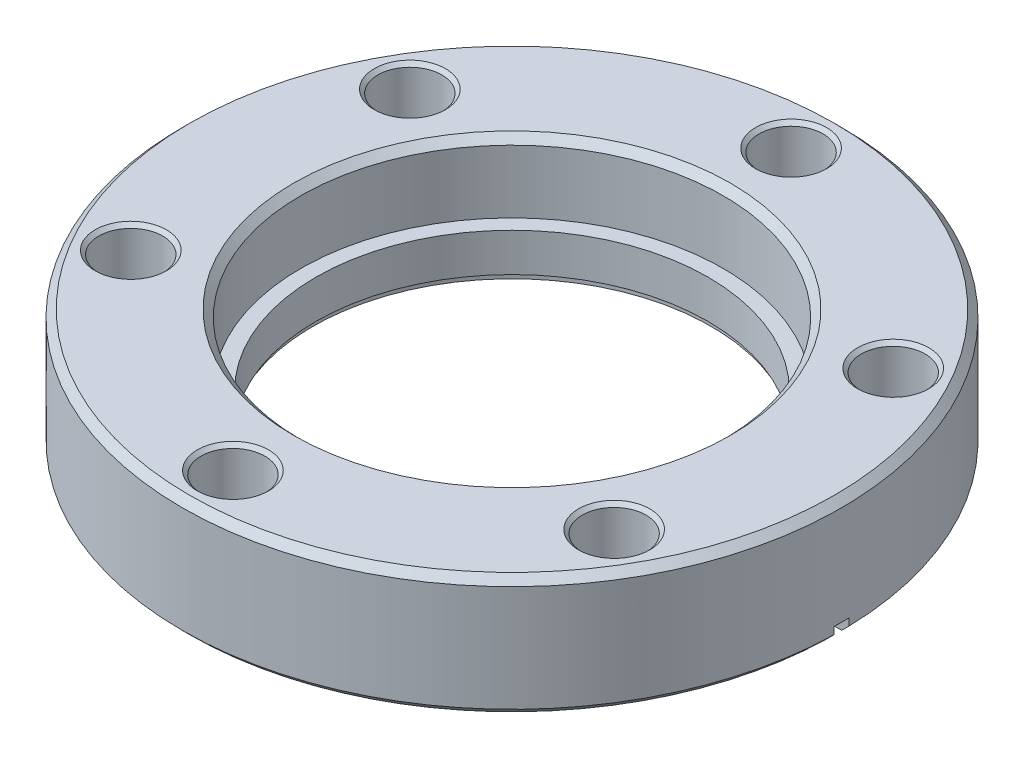
ISO-10303-21;
HEADER;
FILE_DESCRIPTION(('STEP AP214'),'2;1');
FILE_NAME('part.step','',(''),(''),'','','');
FILE_SCHEMA(('AUTOMOTIVE_DESIGN { 1 0 10303 214 1 1 1 1 }'));
ENDSEC;
DATA;
#1=APPLICATION_CONTEXT('core data for automotive mechanical design processes');
#2=APPLICATION_PROTOCOL_DEFINITION('international standard','automotive_design',2000,#1);
#3=PRODUCT_CONTEXT('',#1,'mechanical');
#4=PRODUCT('Part','Part','',(#3));
#5=PRODUCT_RELATED_PRODUCT_CATEGORY('part','',(#4));
#6=PRODUCT_DEFINITION_FORMATION('','',#4);
#7=PRODUCT_DEFINITION_CONTEXT('part definition',#1,'design');
#8=PRODUCT_DEFINITION('design','',#6,#7);
#9=PRODUCT_DEFINITION_SHAPE('','',#8);
#10=(LENGTH_UNIT() NAMED_UNIT(*) SI_UNIT(.MILLI.,.METRE.));
#11=(NAMED_UNIT(*) PLANE_ANGLE_UNIT() SI_UNIT($,.RADIAN.));
#12=(NAMED_UNIT(*) SI_UNIT($,.STERADIAN.) SOLID_ANGLE_UNIT());
#13=UNCERTAINTY_MEASURE_WITH_UNIT(LENGTH_MEASURE(1.E-05),#10,'distance_accuracy_value','');
#14=(GEOMETRIC_REPRESENTATION_CONTEXT(3) GLOBAL_UNCERTAINTY_ASSIGNED_CONTEXT((#13)) GLOBAL_UNIT_ASSIGNED_CONTEXT((#10,
#11,#12)) REPRESENTATION_CONTEXT('',''));
#15=CARTESIAN_POINT('',(0.,0.,0.));
#16=DIRECTION('',(0.,0.,1.));
#17=DIRECTION('',(1.,0.,0.));
#18=AXIS2_PLACEMENT_3D('',#15,#16,#17);
#19=CARTESIAN_POINT('',(0.,0.,0.));
#20=DIRECTION('',(0.,1.,0.));
#21=DIRECTION('',(0.,0.,1.));
#22=AXIS2_PLACEMENT_3D('',#19,#20,#21);
#23=PLANE('',#22);
#24=CARTESIAN_POINT('',(-25.42858431608,0.,-14.6812000000003));
#25=DIRECTION('',(0.,1.,0.));
#26=DIRECTION('',(0.,0.,1.));
#27=AXIS2_PLACEMENT_3D('',#24,#25,#26);
#28=CIRCLE('',#27,3.74650000000003);
#29=CARTESIAN_POINT('',(-25.42858431608,0.,-10.9347000000003));
#30=VERTEX_POINT('',#29);
#31=EDGE_CURVE('E253',#30,#30,#28,.T.);
#32=ORIENTED_EDGE('',*,*,#31,.T.);
#33=EDGE_LOOP('',(#32));
#34=FACE_BOUND('',#33,.T.);
#35=CARTESIAN_POINT('',(25.4285843160802,0.,-14.6811999999999));
#36=DIRECTION('',(0.,1.,0.));
#37=DIRECTION('',(0.,0.,1.));
#38=AXIS2_PLACEMENT_3D('',#35,#36,#37);
#39=CIRCLE('',#38,3.7465);
#40=CARTESIAN_POINT('',(25.4285843160802,0.,-10.9346999999999));
#41=VERTEX_POINT('',#40);
#42=EDGE_CURVE('E257',#41,#41,#39,.T.);
#43=ORIENTED_EDGE('',*,*,#42,.T.);
#44=EDGE_LOOP('',(#43));
#45=FACE_BOUND('',#44,.T.);
#46=CARTESIAN_POINT('',(0.,0.,-29.3624));
#47=DIRECTION('',(0.,1.,0.));
#48=DIRECTION('',(0.,0.,1.));
#49=AXIS2_PLACEMENT_3D('',#46,#47,#48);
#50=CIRCLE('',#49,3.74649999999999);
#51=CARTESIAN_POINT('',(0.,0.,-25.6159));
#52=VERTEX_POINT('',#51);
#53=EDGE_CURVE('E261',#52,#52,#50,.T.);
#54=ORIENTED_EDGE('',*,*,#53,.T.);
#55=EDGE_LOOP('',(#54));
#56=FACE_BOUND('',#55,.T.);
#57=DIRECTION('',(1.,0.,0.));
#58=VECTOR('',#57,1.);
#59=CARTESIAN_POINT('',(0.,0.,-0.79375));
#60=LINE('',#59,#58);
#61=CARTESIAN_POINT('',(-33.8997085818964,0.,-0.79375));
#62=VERTEX_POINT('',#61);
#63=CARTESIAN_POINT('',(-24.1423551066896,0.,-0.79375));
#64=VERTEX_POINT('',#63);
#65=EDGE_CURVE('E115',#62,#64,#60,.T.);
#66=ORIENTED_EDGE('',*,*,#65,.F.);
#67=CARTESIAN_POINT('',(0.,0.,0.));
#68=DIRECTION('',(0.,1.,0.));
#69=DIRECTION('',(0.,0.,1.));
#70=AXIS2_PLACEMENT_3D('',#67,#68,#69);
#71=CIRCLE('',#70,33.909);
#72=CARTESIAN_POINT('',(33.8997085818964,0.,-0.79375));
#73=VERTEX_POINT('',#72);
#74=EDGE_CURVE('E266',#62,#73,#71,.F.);
#75=ORIENTED_EDGE('',*,*,#74,.T.);
#76=DIRECTION('',(-1.,0.,0.));
#77=VECTOR('',#76,1.);
#78=CARTESIAN_POINT('',(0.,0.,-0.79375));
#79=LINE('',#78,#77);
#80=CARTESIAN_POINT('',(24.1423551066896,0.,-0.79375));
#81=VERTEX_POINT('',#80);
#82=EDGE_CURVE('E685',#73,#81,#79,.T.);
#83=ORIENTED_EDGE('',*,*,#82,.T.);
#84=CARTESIAN_POINT('',(0.,0.,0.));
#85=DIRECTION('',(0.,1.,0.));
#86=DIRECTION('',(0.,0.,1.));
#87=AXIS2_PLACEMENT_3D('',#84,#85,#86);
#88=CIRCLE('',#87,24.1554);
#89=EDGE_CURVE('E269',#81,#64,#88,.T.);
#90=ORIENTED_EDGE('',*,*,#89,.T.);
#91=EDGE_LOOP('',(#66,#75,#83,#90));
#92=FACE_BOUND('',#91,.T.);
#93=ADVANCED_FACE('F32',(#34,#45,#56,#92),#23,.F.);
#94=CARTESIAN_POINT('',(0.,12.7,0.));
#95=DIRECTION('',(0.,-1.,0.));
#96=DIRECTION('',(0.,0.,-1.));
#97=AXIS2_PLACEMENT_3D('',#94,#95,#96);
#98=CYLINDRICAL_SURFACE('',#97,34.671);
#99=CARTESIAN_POINT('',(0.,11.938,0.));
#100=DIRECTION('',(0.,1.,0.));
#101=DIRECTION('',(0.,0.,1.));
#102=AXIS2_PLACEMENT_3D('',#99,#100,#101);
#103=CIRCLE('',#102,34.671);
#104=CARTESIAN_POINT('',(0.,11.938,34.671));
#105=VERTEX_POINT('',#104);
#106=EDGE_CURVE('E667',#105,#105,#103,.F.);
#107=ORIENTED_EDGE('',*,*,#106,.T.);
#108=EDGE_LOOP('',(#107));
#109=FACE_BOUND('',#108,.T.);
#110=DIRECTION('',(0.,-1.,0.));
#111=VECTOR('',#110,1.);
#112=CARTESIAN_POINT('',(-34.6619128430255,12.7,-0.79375));
#113=LINE('',#112,#111);
#114=CARTESIAN_POINT('',(-34.6619128430255,1.51703707780505,-0.79375));
#115=VERTEX_POINT('',#114);
#116=CARTESIAN_POINT('',(-34.6619128430255,0.761999999999984,-0.79375));
#117=VERTEX_POINT('',#116);
#118=EDGE_CURVE('E129',#115,#117,#113,.T.);
#119=ORIENTED_EDGE('',*,*,#118,.F.);
#120=CARTESIAN_POINT('',(0.,-0.299516800000002,0.));
#121=DIRECTION('',(0.0523359562429369,0.998629534754574,0.));
#122=DIRECTION('',(0.998629534754574,-0.0523359562429369,0.));
#123=AXIS2_PLACEMENT_3D('',#120,#121,#122);
#124=ELLIPSE('',#123,34.7185806080939,34.671);
#125=CARTESIAN_POINT('',(-34.6619128430255,1.51703707780505,0.79375));
#126=VERTEX_POINT('',#125);
#127=EDGE_CURVE('E120',#115,#126,#124,.T.);
#128=ORIENTED_EDGE('',*,*,#127,.T.);
#129=DIRECTION('',(0.,-1.,0.));
#130=VECTOR('',#129,1.);
#131=CARTESIAN_POINT('',(-34.6619128430255,12.7,0.79375));
#132=LINE('',#131,#130);
#133=CARTESIAN_POINT('',(-34.6619128430255,0.761999999999984,0.79375));
#134=VERTEX_POINT('',#133);
#135=EDGE_CURVE('E108',#126,#134,#132,.T.);
#136=ORIENTED_EDGE('',*,*,#135,.T.);
#137=CARTESIAN_POINT('',(0.,0.761999999999985,0.));
#138=DIRECTION('',(0.,1.,0.));
#139=DIRECTION('',(0.,0.,1.));
#140=AXIS2_PLACEMENT_3D('',#137,#138,#139);
#141=CIRCLE('',#140,34.671);
#142=CARTESIAN_POINT('',(34.6619128430255,0.761999999999984,0.79375));
#143=VERTEX_POINT('',#142);
#144=EDGE_CURVE('E283',#134,#143,#141,.T.);
#145=ORIENTED_EDGE('',*,*,#144,.T.);
#146=DIRECTION('',(0.,-1.,0.));
#147=VECTOR('',#146,1.);
#148=CARTESIAN_POINT('',(34.6619128430255,12.7,0.79375));
#149=LINE('',#148,#147);
#150=CARTESIAN_POINT('',(34.6619128430255,1.51703707780506,0.79375));
#151=VERTEX_POINT('',#150);
#152=EDGE_CURVE('E151',#151,#143,#149,.T.);
#153=ORIENTED_EDGE('',*,*,#152,.F.);
#154=CARTESIAN_POINT('',(0.,-0.2995168,0.));
#155=DIRECTION('',(-0.052335956242937,0.998629534754574,0.));
#156=DIRECTION('',(-0.998629534754574,-0.052335956242937,0.));
#157=AXIS2_PLACEMENT_3D('',#154,#155,#156);
#158=ELLIPSE('',#157,34.7185806080939,34.671);
#159=CARTESIAN_POINT('',(34.6619128430255,1.51703707780506,-0.79375));
#160=VERTEX_POINT('',#159);
#161=EDGE_CURVE('E694',#151,#160,#158,.T.);
#162=ORIENTED_EDGE('',*,*,#161,.T.);
#163=DIRECTION('',(0.,-1.,0.));
#164=VECTOR('',#163,1.);
#165=CARTESIAN_POINT('',(34.6619128430255,12.7,-0.79375));
#166=LINE('',#165,#164);
#167=CARTESIAN_POINT('',(34.6619128430255,0.761999999999984,-0.79375));
#168=VERTEX_POINT('',#167);
#169=EDGE_CURVE('E686',#160,#168,#166,.T.);
#170=ORIENTED_EDGE('',*,*,#169,.T.);
#171=EDGE_CURVE('E279',#168,#117,#141,.T.);
#172=ORIENTED_EDGE('',*,*,#171,.T.);
#173=EDGE_LOOP('',(#119,#128,#136,#145,#153,#162,#170,#172));
#174=FACE_BOUND('',#173,.T.);
#175=ADVANCED_FACE('F127',(#109,#174),#98,.T.);
#176=CARTESIAN_POINT('',(0.,0.761999999999985,0.));
#177=DIRECTION('',(0.,1.,0.));
#178=DIRECTION('',(0.,0.,1.));
#179=AXIS2_PLACEMENT_3D('',#176,#177,#178);
#180=CONICAL_SURFACE('',#179,34.671,0.785398163397453);
#181=ORIENTED_EDGE('',*,*,#74,.F.);
#182=CARTESIAN_POINT('',(-19.8162171152629,-14.0768921992204,-0.79375));
#183=CARTESIAN_POINT('',(-20.9812335307025,-12.912799557824,-0.79375));
#184=CARTESIAN_POINT('',(-22.1461782104416,-11.7486351324414,-0.79375));
#185=CARTESIAN_POINT('',(-24.4759641840109,-9.4202028418735,-0.79375));
#186=CARTESIAN_POINT('',(-25.6408054778415,-8.2559349766886,-0.79375));
#187=CARTESIAN_POINT('',(-29.1352344081955,-4.76303641419953,-0.79375));
#188=CARTESIAN_POINT('',(-31.4647271051946,-2.4343107383554,-0.79375));
#189=CARTESIAN_POINT('',(-36.123587206694,2.22326591141915,-0.79375));
#190=CARTESIAN_POINT('',(-38.4529546111951,4.55211688534891,-0.79375));
#191=CARTESIAN_POINT('',(-43.1116115928339,9.20989669825734,-0.79375));
#192=CARTESIAN_POINT('',(-45.4409011699713,11.5388255372364,-0.79375));
#193=CARTESIAN_POINT('',(-47.7701755486075,13.8677695748391,-0.79375));
#194=B_SPLINE_CURVE_WITH_KNOTS('',3,(#182,#183,#184,#185,#186,#187,#188,#189,#190,#191,#192,
#193),.UNSPECIFIED.,.F.,.F.,(4,2,2,2,2,4),(0.,4.94078680141497,9.88157358713812,19.76314710933,
29.644720579459,39.5262940973138),.UNSPECIFIED.);
#195=EDGE_CURVE('E135',#62,#117,#194,.T.);
#196=ORIENTED_EDGE('',*,*,#195,.T.);
#197=ORIENTED_EDGE('',*,*,#171,.F.);
#198=CARTESIAN_POINT('',(19.8162171152629,-14.0768921992204,-0.79375));
#199=CARTESIAN_POINT('',(20.9812335307025,-12.912799557824,-0.79375));
#200=CARTESIAN_POINT('',(22.1461782104416,-11.7486351324414,-0.79375));
#201=CARTESIAN_POINT('',(24.4759641840109,-9.4202028418735,-0.79375));
#202=CARTESIAN_POINT('',(25.6408054778415,-8.2559349766886,-0.79375));
#203=CARTESIAN_POINT('',(29.1352344081955,-4.76303641419953,-0.79375));
#204=CARTESIAN_POINT('',(31.4647271051946,-2.4343107383554,-0.79375));
#205=CARTESIAN_POINT('',(36.123587206694,2.22326591141915,-0.79375));
#206=CARTESIAN_POINT('',(38.4529546111951,4.55211688534891,-0.79375));
#207=CARTESIAN_POINT('',(43.1116115928339,9.20989669825734,-0.79375));
#208=CARTESIAN_POINT('',(45.4409011699713,11.5388255372364,-0.79375));
#209=CARTESIAN_POINT('',(47.7701755486075,13.8677695748391,-0.79375));
#210=B_SPLINE_CURVE_WITH_KNOTS('',3,(#198,#199,#200,#201,#202,#203,#204,#205,#206,#207,#208,
#209),.UNSPECIFIED.,.F.,.F.,(4,2,2,2,2,4),(0.,4.94078680141497,9.88157358713812,19.76314710933,
29.644720579459,39.5262940973138),.UNSPECIFIED.);
#211=EDGE_CURVE('E277',#73,#168,#210,.T.);
#212=ORIENTED_EDGE('',*,*,#211,.F.);
#213=EDGE_LOOP('',(#181,#196,#197,#212));
#214=FACE_BOUND('',#213,.T.);
#215=ADVANCED_FACE('F202',(#214),#180,.T.);
#216=CARTESIAN_POINT('',(0.,5.3086,0.));
#217=DIRECTION('',(0.,1.,0.));
#218=DIRECTION('',(0.,0.,1.));
#219=AXIS2_PLACEMENT_3D('',#216,#217,#218);
#220=CYLINDRICAL_SURFACE('',#219,24.1554);
#221=CARTESIAN_POINT('',(0.,1.825244,0.));
#222=DIRECTION('',(0.,1.,0.));
#223=DIRECTION('',(0.,0.,1.));
#224=AXIS2_PLACEMENT_3D('',#221,#222,#223);
#225=CIRCLE('',#224,24.1554);
#226=CARTESIAN_POINT('',(0.,1.825244,24.1554));
#227=VERTEX_POINT('',#226);
#228=EDGE_CURVE('E697',#227,#227,#225,.T.);
#229=ORIENTED_EDGE('',*,*,#228,.T.);
#230=EDGE_LOOP('',(#229));
#231=FACE_BOUND('',#230,.T.);
#232=DIRECTION('',(0.,1.,0.));
#233=VECTOR('',#232,1.);
#234=CARTESIAN_POINT('',(-24.1423551066896,5.3086,-0.79375));
#235=LINE('',#234,#233);
#236=CARTESIAN_POINT('',(-24.1423551066896,0.965730417804022,-0.79375));
#237=VERTEX_POINT('',#236);
#238=EDGE_CURVE('E11',#64,#237,#235,.T.);
#239=ORIENTED_EDGE('',*,*,#238,.F.);
#240=ORIENTED_EDGE('',*,*,#89,.F.);
#241=DIRECTION('',(0.,1.,0.));
#242=VECTOR('',#241,1.);
#243=CARTESIAN_POINT('',(24.1423551066896,5.3086,-0.79375));
#244=LINE('',#243,#242);
#245=CARTESIAN_POINT('',(24.1423551066896,0.965730417804024,-0.79375));
#246=VERTEX_POINT('',#245);
#247=EDGE_CURVE('E362',#81,#246,#244,.T.);
#248=ORIENTED_EDGE('',*,*,#247,.T.);
#249=CARTESIAN_POINT('',(0.,-0.2995168,0.));
#250=DIRECTION('',(-0.052335956242937,0.998629534754574,0.));
#251=DIRECTION('',(0.998629534754574,0.052335956242937,0.));
#252=AXIS2_PLACEMENT_3D('',#249,#250,#251);
#253=ELLIPSE('',#252,24.1885495665182,24.1554);
#254=CARTESIAN_POINT('',(24.1423551066896,0.965730417804024,0.79375));
#255=VERTEX_POINT('',#254);
#256=EDGE_CURVE('E359',#246,#255,#253,.F.);
#257=ORIENTED_EDGE('',*,*,#256,.T.);
#258=DIRECTION('',(0.,1.,0.));
#259=VECTOR('',#258,1.);
#260=CARTESIAN_POINT('',(24.1423551066896,5.3086,0.79375));
#261=LINE('',#260,#259);
#262=CARTESIAN_POINT('',(24.1423551066896,0.,0.79375));
#263=VERTEX_POINT('',#262);
#264=EDGE_CURVE('E357',#263,#255,#261,.T.);
#265=ORIENTED_EDGE('',*,*,#264,.F.);
#266=CARTESIAN_POINT('',(-24.1423551066896,0.,0.79375));
#267=VERTEX_POINT('',#266);
#268=EDGE_CURVE('E55',#267,#263,#88,.T.);
#269=ORIENTED_EDGE('',*,*,#268,.F.);
#270=DIRECTION('',(0.,1.,0.));
#271=VECTOR('',#270,1.);
#272=CARTESIAN_POINT('',(-24.1423551066896,5.3086,0.79375));
#273=LINE('',#272,#271);
#274=CARTESIAN_POINT('',(-24.1423551066896,0.965730417804022,0.79375));
#275=VERTEX_POINT('',#274);
#276=EDGE_CURVE('E365',#267,#275,#273,.T.);
#277=ORIENTED_EDGE('',*,*,#276,.T.);
#278=CARTESIAN_POINT('',(0.,-0.299516800000001,0.));
#279=DIRECTION('',(0.0523359562429369,0.998629534754574,0.));
#280=DIRECTION('',(-0.998629534754574,0.0523359562429369,0.));
#281=AXIS2_PLACEMENT_3D('',#278,#279,#280);
#282=ELLIPSE('',#281,24.1885495665182,24.1554);
#283=EDGE_CURVE('E40',#275,#237,#282,.F.);
#284=ORIENTED_EDGE('',*,*,#283,.T.);
#285=EDGE_LOOP('',(#239,#240,#248,#257,#265,#269,#277,#284));
#286=FACE_BOUND('',#285,.T.);
#287=ADVANCED_FACE('F198',(#231,#286),#220,.F.);
#288=CARTESIAN_POINT('',(0.,12.7,0.));
#289=DIRECTION('',(0.,-1.,0.));
#290=DIRECTION('',(0.,0.,-1.));
#291=AXIS2_PLACEMENT_3D('',#288,#289,#290);
#292=CYLINDRICAL_SURFACE('',#291,20.6375);
#293=CARTESIAN_POINT('',(0.,1.27,0.));
#294=DIRECTION('',(0.,1.,0.));
#295=DIRECTION('',(0.,0.,1.));
#296=AXIS2_PLACEMENT_3D('',#293,#294,#295);
#297=CIRCLE('',#296,20.6375);
#298=CARTESIAN_POINT('',(0.,1.27,20.6375));
#299=VERTEX_POINT('',#298);
#300=EDGE_CURVE('E287',#299,#299,#297,.T.);
#301=ORIENTED_EDGE('',*,*,#300,.F.);
#302=EDGE_LOOP('',(#301));
#303=FACE_BOUND('',#302,.T.);
#304=CARTESIAN_POINT('',(0.,5.3086,0.));
#305=DIRECTION('',(0.,1.,0.));
#306=DIRECTION('',(0.,0.,1.));
#307=AXIS2_PLACEMENT_3D('',#304,#305,#306);
#308=CIRCLE('',#307,20.6375);
#309=CARTESIAN_POINT('',(0.,5.3086,20.6375));
#310=VERTEX_POINT('',#309);
#311=EDGE_CURVE('E678',#310,#310,#308,.T.);
#312=ORIENTED_EDGE('',*,*,#311,.T.);
#313=EDGE_LOOP('',(#312));
#314=FACE_BOUND('',#313,.T.);
#315=ADVANCED_FACE('F201',(#303,#314),#292,.F.);
#316=CARTESIAN_POINT('',(0.,12.7,0.));
#317=DIRECTION('',(0.,1.,0.));
#318=DIRECTION('',(0.,0.,1.));
#319=AXIS2_PLACEMENT_3D('',#316,#317,#318);
#320=PLANE('',#319);
#321=CARTESIAN_POINT('',(-25.42858431608,12.7,-14.6812000000003));
#322=DIRECTION('',(0.,1.,0.));
#323=DIRECTION('',(0.,0.,1.));
#324=AXIS2_PLACEMENT_3D('',#321,#322,#323);
#325=CIRCLE('',#324,3.74649999999998);
#326=CARTESIAN_POINT('',(-25.42858431608,12.7,-10.9347000000003));
#327=VERTEX_POINT('',#326);
#328=EDGE_CURVE('E353',#327,#327,#325,.F.);
#329=ORIENTED_EDGE('',*,*,#328,.T.);
#330=EDGE_LOOP('',(#329));
#331=FACE_BOUND('',#330,.T.);
#332=CARTESIAN_POINT('',(-25.4285843160803,12.7,14.6811999999998));
#333=DIRECTION('',(0.,1.,0.));
#334=DIRECTION('',(0.,0.,1.));
#335=AXIS2_PLACEMENT_3D('',#332,#333,#334);
#336=CIRCLE('',#335,3.74650000000001);
#337=CARTESIAN_POINT('',(-25.4285843160803,12.7,18.4276999999998));
#338=VERTEX_POINT('',#337);
#339=EDGE_CURVE('E341',#338,#338,#336,.F.);
#340=ORIENTED_EDGE('',*,*,#339,.T.);
#341=EDGE_LOOP('',(#340));
#342=FACE_BOUND('',#341,.T.);
#343=CARTESIAN_POINT('',(0.,12.7,29.3624));
#344=DIRECTION('',(0.,1.,0.));
#345=DIRECTION('',(0.,0.,1.));
#346=AXIS2_PLACEMENT_3D('',#343,#344,#345);
#347=CIRCLE('',#346,3.74650000000001);
#348=CARTESIAN_POINT('',(0.,12.7,33.1089));
#349=VERTEX_POINT('',#348);
#350=EDGE_CURVE('E329',#349,#349,#347,.F.);
#351=ORIENTED_EDGE('',*,*,#350,.T.);
#352=EDGE_LOOP('',(#351));
#353=FACE_BOUND('',#352,.T.);
#354=CARTESIAN_POINT('',(25.4285843160801,12.7,14.6812000000001));
#355=DIRECTION('',(0.,1.,0.));
#356=DIRECTION('',(0.,0.,1.));
#357=AXIS2_PLACEMENT_3D('',#354,#355,#356);
#358=CIRCLE('',#357,3.7465);
#359=CARTESIAN_POINT('',(25.4285843160801,12.7,18.4277000000001));
#360=VERTEX_POINT('',#359);
#361=EDGE_CURVE('E317',#360,#360,#358,.F.);
#362=ORIENTED_EDGE('',*,*,#361,.T.);
#363=EDGE_LOOP('',(#362));
#364=FACE_BOUND('',#363,.T.);
#365=CARTESIAN_POINT('',(25.4285843160802,12.7,-14.6811999999999));
#366=DIRECTION('',(0.,1.,0.));
#367=DIRECTION('',(0.,0.,1.));
#368=AXIS2_PLACEMENT_3D('',#365,#366,#367);
#369=CIRCLE('',#368,3.74650000000001);
#370=CARTESIAN_POINT('',(25.4285843160802,12.7,-10.9346999999999));
#371=VERTEX_POINT('',#370);
#372=EDGE_CURVE('E307',#371,#371,#369,.F.);
#373=ORIENTED_EDGE('',*,*,#372,.T.);
#374=EDGE_LOOP('',(#373));
#375=FACE_BOUND('',#374,.T.);
#376=CARTESIAN_POINT('',(0.,12.7,-29.3624));
#377=DIRECTION('',(0.,1.,0.));
#378=DIRECTION('',(0.,0.,1.));
#379=AXIS2_PLACEMENT_3D('',#376,#377,#378);
#380=CIRCLE('',#379,3.74650000000001);
#381=CARTESIAN_POINT('',(0.,12.7,-25.6159));
#382=VERTEX_POINT('',#381);
#383=EDGE_CURVE('E297',#382,#382,#380,.F.);
#384=ORIENTED_EDGE('',*,*,#383,.T.);
#385=EDGE_LOOP('',(#384));
#386=FACE_BOUND('',#385,.T.);
#387=CARTESIAN_POINT('',(0.,12.7,0.));
#388=DIRECTION('',(0.,1.,0.));
#389=DIRECTION('',(0.,0.,1.));
#390=AXIS2_PLACEMENT_3D('',#387,#388,#389);
#391=CIRCLE('',#390,22.987);
#392=CARTESIAN_POINT('',(0.,12.7,22.987));
#393=VERTEX_POINT('',#392);
#394=EDGE_CURVE('E672',#393,#393,#391,.F.);
#395=ORIENTED_EDGE('',*,*,#394,.T.);
#396=EDGE_LOOP('',(#395));
#397=FACE_BOUND('',#396,.T.);
#398=CARTESIAN_POINT('',(0.,12.7,0.));
#399=DIRECTION('',(0.,1.,0.));
#400=DIRECTION('',(0.,0.,1.));
#401=AXIS2_PLACEMENT_3D('',#398,#399,#400);
#402=CIRCLE('',#401,33.909);
#403=CARTESIAN_POINT('',(0.,12.7,33.909));
#404=VERTEX_POINT('',#403);
#405=EDGE_CURVE('E670',#404,#404,#402,.T.);
#406=ORIENTED_EDGE('',*,*,#405,.T.);
#407=EDGE_LOOP('',(#406));
#408=FACE_BOUND('',#407,.T.);
#409=ADVANCED_FACE('F228',(#331,#342,#353,#364,#375,#386,#397,#408),#320,.T.);
#410=CARTESIAN_POINT('',(-25.4285843160803,0.,14.6811999999998));
#411=DIRECTION('',(0.,1.,0.));
#412=DIRECTION('',(0.,0.,1.));
#413=AXIS2_PLACEMENT_3D('',#410,#411,#412);
#414=CIRCLE('',#413,3.7465);
#415=CARTESIAN_POINT('',(-25.4285843160803,0.,18.4276999999998));
#416=VERTEX_POINT('',#415);
#417=EDGE_CURVE('E344',#416,#416,#414,.T.);
#418=ORIENTED_EDGE('',*,*,#417,.T.);
#419=EDGE_LOOP('',(#418));
#420=FACE_BOUND('',#419,.T.);
#421=CARTESIAN_POINT('',(0.,0.,29.3624));
#422=DIRECTION('',(0.,1.,0.));
#423=DIRECTION('',(0.,0.,1.));
#424=AXIS2_PLACEMENT_3D('',#421,#422,#423);
#425=CIRCLE('',#424,3.74649999999999);
#426=CARTESIAN_POINT('',(0.,0.,33.1089));
#427=VERTEX_POINT('',#426);
#428=EDGE_CURVE('E332',#427,#427,#425,.T.);
#429=ORIENTED_EDGE('',*,*,#428,.T.);
#430=EDGE_LOOP('',(#429));
#431=FACE_BOUND('',#430,.T.);
#432=CARTESIAN_POINT('',(25.4285843160801,0.,14.6812000000001));
#433=DIRECTION('',(0.,1.,0.));
#434=DIRECTION('',(0.,0.,1.));
#435=AXIS2_PLACEMENT_3D('',#432,#433,#434);
#436=CIRCLE('',#435,3.74650000000002);
#437=CARTESIAN_POINT('',(25.4285843160801,0.,18.4277000000001));
#438=VERTEX_POINT('',#437);
#439=EDGE_CURVE('E320',#438,#438,#436,.T.);
#440=ORIENTED_EDGE('',*,*,#439,.T.);
#441=EDGE_LOOP('',(#440));
#442=FACE_BOUND('',#441,.T.);
#443=CARTESIAN_POINT('',(33.8997085818964,0.,0.79375));
#444=VERTEX_POINT('',#443);
#445=CARTESIAN_POINT('',(-33.8997085818964,0.,0.79375));
#446=VERTEX_POINT('',#445);
#447=EDGE_CURVE('E278',#444,#446,#71,.F.);
#448=ORIENTED_EDGE('',*,*,#447,.T.);
#449=DIRECTION('',(1.,0.,0.));
#450=VECTOR('',#449,1.);
#451=CARTESIAN_POINT('',(0.,0.,0.79375));
#452=LINE('',#451,#450);
#453=EDGE_CURVE('E368',#446,#267,#452,.T.);
#454=ORIENTED_EDGE('',*,*,#453,.T.);
#455=ORIENTED_EDGE('',*,*,#268,.T.);
#456=DIRECTION('',(-1.,0.,0.));
#457=VECTOR('',#456,1.);
#458=CARTESIAN_POINT('',(0.,0.,0.79375));
#459=LINE('',#458,#457);
#460=EDGE_CURVE('E140',#444,#263,#459,.T.);
#461=ORIENTED_EDGE('',*,*,#460,.F.);
#462=EDGE_LOOP('',(#448,#454,#455,#461));
#463=FACE_BOUND('',#462,.T.);
#464=ADVANCED_FACE('F224',(#420,#431,#442,#463),#23,.F.);
#465=CARTESIAN_POINT('',(0.,5.3086,0.));
#466=DIRECTION('',(0.,1.,0.));
#467=DIRECTION('',(0.,0.,1.));
#468=AXIS2_PLACEMENT_3D('',#465,#466,#467);
#469=CYLINDRICAL_SURFACE('',#468,22.225);
#470=CARTESIAN_POINT('',(0.,11.938,0.));
#471=DIRECTION('',(0.,1.,0.));
#472=DIRECTION('',(0.,0.,1.));
#473=AXIS2_PLACEMENT_3D('',#470,#471,#472);
#474=CIRCLE('',#473,22.225);
#475=CARTESIAN_POINT('',(0.,11.938,22.225));
#476=VERTEX_POINT('',#475);
#477=EDGE_CURVE('E673',#476,#476,#474,.T.);
#478=ORIENTED_EDGE('',*,*,#477,.T.);
#479=EDGE_LOOP('',(#478));
#480=FACE_BOUND('',#479,.T.);
#481=CARTESIAN_POINT('',(0.,5.3086,0.));
#482=DIRECTION('',(0.,1.,0.));
#483=DIRECTION('',(0.,0.,1.));
#484=AXIS2_PLACEMENT_3D('',#481,#482,#483);
#485=CIRCLE('',#484,22.225);
#486=CARTESIAN_POINT('',(0.,5.3086,22.225));
#487=VERTEX_POINT('',#486);
#488=EDGE_CURVE('E290',#487,#487,#485,.T.);
#489=ORIENTED_EDGE('',*,*,#488,.F.);
#490=EDGE_LOOP('',(#489));
#491=FACE_BOUND('',#490,.T.);
#492=ADVANCED_FACE('F220',(#480,#491),#469,.F.);
#493=CARTESIAN_POINT('',(0.,5.3086,0.));
#494=DIRECTION('',(0.,1.,0.));
#495=DIRECTION('',(0.,0.,1.));
#496=AXIS2_PLACEMENT_3D('',#493,#494,#495);
#497=PLANE('',#496);
#498=ORIENTED_EDGE('',*,*,#311,.F.);
#499=EDGE_LOOP('',(#498));
#500=FACE_BOUND('',#499,.T.);
#501=ORIENTED_EDGE('',*,*,#488,.T.);
#502=EDGE_LOOP('',(#501));
#503=FACE_BOUND('',#502,.T.);
#504=ADVANCED_FACE('F216',(#500,#503),#497,.T.);
#505=CARTESIAN_POINT('',(0.,11.938,0.));
#506=DIRECTION('',(0.,1.,0.));
#507=DIRECTION('',(0.,0.,1.));
#508=AXIS2_PLACEMENT_3D('',#505,#506,#507);
#509=CONICAL_SURFACE('',#508,22.225,0.785398163397448);
#510=ORIENTED_EDGE('',*,*,#394,.F.);
#511=EDGE_LOOP('',(#510));
#512=FACE_BOUND('',#511,.T.);
#513=ORIENTED_EDGE('',*,*,#477,.F.);
#514=EDGE_LOOP('',(#513));
#515=FACE_BOUND('',#514,.T.);
#516=ADVANCED_FACE('F219',(#512,#515),#509,.F.);
#517=CARTESIAN_POINT('',(-19.8162171152629,-14.0768921992204,0.79375));
#518=CARTESIAN_POINT('',(-20.9812335307025,-12.912799557824,0.79375));
#519=CARTESIAN_POINT('',(-22.1461782104416,-11.7486351324414,0.79375));
#520=CARTESIAN_POINT('',(-24.4759641840109,-9.4202028418735,0.79375));
#521=CARTESIAN_POINT('',(-25.6408054778415,-8.2559349766886,0.79375));
#522=CARTESIAN_POINT('',(-29.1352344081955,-4.76303641419953,0.79375));
#523=CARTESIAN_POINT('',(-31.4647271051946,-2.4343107383554,0.79375));
#524=CARTESIAN_POINT('',(-36.123587206694,2.22326591141915,0.79375));
#525=CARTESIAN_POINT('',(-38.4529546111951,4.55211688534891,0.79375));
#526=CARTESIAN_POINT('',(-43.1116115928339,9.20989669825734,0.79375));
#527=CARTESIAN_POINT('',(-45.4409011699713,11.5388255372364,0.79375));
#528=CARTESIAN_POINT('',(-47.7701755486075,13.8677695748391,0.79375));
#529=B_SPLINE_CURVE_WITH_KNOTS('',3,(#517,#518,#519,#520,#521,#522,#523,#524,#525,#526,#527,
#528),.UNSPECIFIED.,.F.,.F.,(4,2,2,2,2,4),(0.,4.94078680141497,9.88157358713812,19.76314710933,
29.644720579459,39.5262940973138),.UNSPECIFIED.);
#530=EDGE_CURVE('E111',#446,#134,#529,.T.);
#531=ORIENTED_EDGE('',*,*,#530,.F.);
#532=ORIENTED_EDGE('',*,*,#447,.F.);
#533=CARTESIAN_POINT('',(19.8162171152629,-14.0768921992204,0.79375));
#534=CARTESIAN_POINT('',(20.9812335307025,-12.912799557824,0.79375));
#535=CARTESIAN_POINT('',(22.1461782104416,-11.7486351324414,0.79375));
#536=CARTESIAN_POINT('',(24.4759641840109,-9.4202028418735,0.79375));
#537=CARTESIAN_POINT('',(25.6408054778415,-8.2559349766886,0.79375));
#538=CARTESIAN_POINT('',(29.1352344081955,-4.76303641419953,0.79375));
#539=CARTESIAN_POINT('',(31.4647271051946,-2.4343107383554,0.79375));
#540=CARTESIAN_POINT('',(36.123587206694,2.22326591141915,0.79375));
#541=CARTESIAN_POINT('',(38.4529546111951,4.55211688534891,0.79375));
#542=CARTESIAN_POINT('',(43.1116115928339,9.20989669825734,0.79375));
#543=CARTESIAN_POINT('',(45.4409011699713,11.5388255372364,0.79375));
#544=CARTESIAN_POINT('',(47.7701755486075,13.8677695748391,0.79375));
#545=B_SPLINE_CURVE_WITH_KNOTS('',3,(#533,#534,#535,#536,#537,#538,#539,#540,#541,#542,#543,
#544),.UNSPECIFIED.,.F.,.F.,(4,2,2,2,2,4),(0.,4.94078680141497,9.88157358713812,19.76314710933,
29.644720579459,39.5262940973138),.UNSPECIFIED.);
#546=EDGE_CURVE('E143',#444,#143,#545,.T.);
#547=ORIENTED_EDGE('',*,*,#546,.T.);
#548=ORIENTED_EDGE('',*,*,#144,.F.);
#549=EDGE_LOOP('',(#531,#532,#547,#548));
#550=FACE_BOUND('',#549,.T.);
#551=ADVANCED_FACE('F153',(#550),#180,.T.);
#552=CARTESIAN_POINT('',(0.,12.7,0.));
#553=DIRECTION('',(0.,-1.,0.));
#554=DIRECTION('',(0.,0.,-1.));
#555=AXIS2_PLACEMENT_3D('',#552,#553,#554);
#556=CONICAL_SURFACE('',#555,33.909,0.785398163397444);
#557=ORIENTED_EDGE('',*,*,#106,.F.);
#558=EDGE_LOOP('',(#557));
#559=FACE_BOUND('',#558,.T.);
#560=ORIENTED_EDGE('',*,*,#405,.F.);
#561=EDGE_LOOP('',(#560));
#562=FACE_BOUND('',#561,.T.);
#563=ADVANCED_FACE('F214',(#559,#562),#556,.T.);
#564=CARTESIAN_POINT('',(-20.955,1.27,0.));
#565=DIRECTION('',(0.,1.,0.));
#566=DIRECTION('',(0.,0.,1.));
#567=AXIS2_PLACEMENT_3D('',#564,#565,#566);
#568=PLANE('',#567);
#569=ORIENTED_EDGE('',*,*,#300,.T.);
#570=EDGE_LOOP('',(#569));
#571=FACE_BOUND('',#570,.T.);
#572=CARTESIAN_POINT('',(0.,1.27,0.));
#573=DIRECTION('',(0.,1.,0.));
#574=DIRECTION('',(0.,0.,1.));
#575=AXIS2_PLACEMENT_3D('',#572,#573,#574);
#576=CIRCLE('',#575,20.955);
#577=CARTESIAN_POINT('',(0.,1.27,20.955));
#578=VERTEX_POINT('',#577);
#579=EDGE_CURVE('E291',#578,#578,#576,.T.);
#580=ORIENTED_EDGE('',*,*,#579,.F.);
#581=EDGE_LOOP('',(#580));
#582=FACE_BOUND('',#581,.T.);
#583=ADVANCED_FACE('F210',(#571,#582),#568,.F.);
#584=CARTESIAN_POINT('',(0.,5.3086,0.));
#585=DIRECTION('',(0.,1.,0.));
#586=DIRECTION('',(0.,0.,1.));
#587=AXIS2_PLACEMENT_3D('',#584,#585,#586);
#588=CYLINDRICAL_SURFACE('',#587,20.955);
#589=CARTESIAN_POINT('',(0.,0.6604,0.));
#590=DIRECTION('',(0.,1.,0.));
#591=DIRECTION('',(0.,0.,1.));
#592=AXIS2_PLACEMENT_3D('',#589,#590,#591);
#593=CIRCLE('',#592,20.955);
#594=CARTESIAN_POINT('',(0.,0.6604,20.955));
#595=VERTEX_POINT('',#594);
#596=EDGE_CURVE('E700',#595,#595,#593,.T.);
#597=ORIENTED_EDGE('',*,*,#596,.F.);
#598=EDGE_LOOP('',(#597));
#599=FACE_BOUND('',#598,.T.);
#600=ORIENTED_EDGE('',*,*,#579,.T.);
#601=EDGE_LOOP('',(#600));
#602=FACE_BOUND('',#601,.T.);
#603=ADVANCED_FACE('F206',(#599,#602),#588,.F.);
#604=CARTESIAN_POINT('',(0.,0.6604,0.));
#605=DIRECTION('',(0.,1.,0.));
#606=DIRECTION('',(0.,0.,1.));
#607=AXIS2_PLACEMENT_3D('',#604,#605,#606);
#608=CONICAL_SURFACE('',#607,20.955,1.22173222504424);
#609=ORIENTED_EDGE('',*,*,#228,.F.);
#610=EDGE_LOOP('',(#609));
#611=FACE_BOUND('',#610,.T.);
#612=ORIENTED_EDGE('',*,*,#596,.T.);
#613=EDGE_LOOP('',(#612));
#614=FACE_BOUND('',#613,.T.);
#615=ADVANCED_FACE('F196',(#611,#614),#608,.T.);
#616=CARTESIAN_POINT('',(0.,0.,-29.3624));
#617=DIRECTION('',(0.,1.,0.));
#618=DIRECTION('',(0.,0.,1.));
#619=AXIS2_PLACEMENT_3D('',#616,#617,#618);
#620=CYLINDRICAL_SURFACE('',#619,3.3655);
#621=CARTESIAN_POINT('',(0.,12.319,-29.3624));
#622=DIRECTION('',(0.,1.,0.));
#623=DIRECTION('',(0.,0.,1.));
#624=AXIS2_PLACEMENT_3D('',#621,#622,#623);
#625=CIRCLE('',#624,3.3655);
#626=CARTESIAN_POINT('',(0.,12.319,-25.9969));
#627=VERTEX_POINT('',#626);
#628=EDGE_CURVE('E294',#627,#627,#625,.T.);
#629=ORIENTED_EDGE('',*,*,#628,.T.);
#630=EDGE_LOOP('',(#629));
#631=FACE_BOUND('',#630,.T.);
#632=CARTESIAN_POINT('',(0.,0.380999999999998,-29.3624));
#633=DIRECTION('',(0.,1.,0.));
#634=DIRECTION('',(0.,0.,1.));
#635=AXIS2_PLACEMENT_3D('',#632,#633,#634);
#636=CIRCLE('',#635,3.3655);
#637=CARTESIAN_POINT('',(0.,0.380999999999998,-25.9969));
#638=VERTEX_POINT('',#637);
#639=EDGE_CURVE('E282',#638,#638,#636,.F.);
#640=ORIENTED_EDGE('',*,*,#639,.T.);
#641=EDGE_LOOP('',(#640));
#642=FACE_BOUND('',#641,.T.);
#643=ADVANCED_FACE('F192',(#631,#642),#620,.F.);
#644=CARTESIAN_POINT('',(0.,12.319,-29.3624));
#645=DIRECTION('',(0.,1.,0.));
#646=DIRECTION('',(0.,0.,1.));
#647=AXIS2_PLACEMENT_3D('',#644,#645,#646);
#648=CONICAL_SURFACE('',#647,3.3655,0.785398163397442);
#649=ORIENTED_EDGE('',*,*,#383,.F.);
#650=EDGE_LOOP('',(#649));
#651=FACE_BOUND('',#650,.T.);
#652=ORIENTED_EDGE('',*,*,#628,.F.);
#653=EDGE_LOOP('',(#652));
#654=FACE_BOUND('',#653,.T.);
#655=ADVANCED_FACE('F195',(#651,#654),#648,.F.);
#656=CARTESIAN_POINT('',(0.,0.,-29.3624));
#657=DIRECTION('',(0.,-1.,0.));
#658=DIRECTION('',(0.,0.,-1.));
#659=AXIS2_PLACEMENT_3D('',#656,#657,#658);
#660=CONICAL_SURFACE('',#659,3.74649999999999,0.785398163397433);
#661=ORIENTED_EDGE('',*,*,#639,.F.);
#662=EDGE_LOOP('',(#661));
#663=FACE_BOUND('',#662,.T.);
#664=ORIENTED_EDGE('',*,*,#53,.F.);
#665=EDGE_LOOP('',(#664));
#666=FACE_BOUND('',#665,.T.);
#667=ADVANCED_FACE('F190',(#663,#666),#660,.F.);
#668=CARTESIAN_POINT('',(25.4285843160802,0.,-14.6811999999999));
#669=DIRECTION('',(0.,1.,0.));
#670=DIRECTION('',(0.,0.,1.));
#671=AXIS2_PLACEMENT_3D('',#668,#669,#670);
#672=CYLINDRICAL_SURFACE('',#671,3.3655);
#673=CARTESIAN_POINT('',(25.4285843160802,12.319,-14.6811999999999));
#674=DIRECTION('',(0.,1.,0.));
#675=DIRECTION('',(0.,0.,1.));
#676=AXIS2_PLACEMENT_3D('',#673,#674,#675);
#677=CIRCLE('',#676,3.3655);
#678=CARTESIAN_POINT('',(25.4285843160802,12.319,-11.3156999999999));
#679=VERTEX_POINT('',#678);
#680=EDGE_CURVE('E304',#679,#679,#677,.T.);
#681=ORIENTED_EDGE('',*,*,#680,.T.);
#682=EDGE_LOOP('',(#681));
#683=FACE_BOUND('',#682,.T.);
#684=CARTESIAN_POINT('',(25.4285843160802,0.380999999999998,-14.6811999999999));
#685=DIRECTION('',(0.,1.,0.));
#686=DIRECTION('',(0.,0.,1.));
#687=AXIS2_PLACEMENT_3D('',#684,#685,#686);
#688=CIRCLE('',#687,3.3655);
#689=CARTESIAN_POINT('',(25.4285843160802,0.380999999999998,-11.3156999999999));
#690=VERTEX_POINT('',#689);
#691=EDGE_CURVE('E301',#690,#690,#688,.F.);
#692=ORIENTED_EDGE('',*,*,#691,.T.);
#693=EDGE_LOOP('',(#692));
#694=FACE_BOUND('',#693,.T.);
#695=ADVANCED_FACE('F186',(#683,#694),#672,.F.);
#696=CARTESIAN_POINT('',(25.4285843160801,0.,14.6812000000001));
#697=DIRECTION('',(0.,1.,0.));
#698=DIRECTION('',(0.,0.,1.));
#699=AXIS2_PLACEMENT_3D('',#696,#697,#698);
#700=CYLINDRICAL_SURFACE('',#699,3.3655);
#701=CARTESIAN_POINT('',(25.4285843160801,12.319,14.6812000000001));
#702=DIRECTION('',(0.,1.,0.));
#703=DIRECTION('',(0.,0.,1.));
#704=AXIS2_PLACEMENT_3D('',#701,#702,#703);
#705=CIRCLE('',#704,3.3655);
#706=CARTESIAN_POINT('',(25.4285843160801,12.319,18.0467000000001));
#707=VERTEX_POINT('',#706);
#708=EDGE_CURVE('E314',#707,#707,#705,.T.);
#709=ORIENTED_EDGE('',*,*,#708,.T.);
#710=EDGE_LOOP('',(#709));
#711=FACE_BOUND('',#710,.T.);
#712=CARTESIAN_POINT('',(25.4285843160801,0.381000000000012,14.6812000000001));
#713=DIRECTION('',(0.,1.,0.));
#714=DIRECTION('',(0.,0.,1.));
#715=AXIS2_PLACEMENT_3D('',#712,#713,#714);
#716=CIRCLE('',#715,3.3655);
#717=CARTESIAN_POINT('',(25.4285843160801,0.381000000000012,18.0467000000001));
#718=VERTEX_POINT('',#717);
#719=EDGE_CURVE('E311',#718,#718,#716,.F.);
#720=ORIENTED_EDGE('',*,*,#719,.T.);
#721=EDGE_LOOP('',(#720));
#722=FACE_BOUND('',#721,.T.);
#723=ADVANCED_FACE('F182',(#711,#722),#700,.F.);
#724=CARTESIAN_POINT('',(0.,0.,29.3624));
#725=DIRECTION('',(0.,1.,0.));
#726=DIRECTION('',(0.,0.,1.));
#727=AXIS2_PLACEMENT_3D('',#724,#725,#726);
#728=CYLINDRICAL_SURFACE('',#727,3.3655);
#729=CARTESIAN_POINT('',(0.,12.319,29.3624));
#730=DIRECTION('',(0.,1.,0.));
#731=DIRECTION('',(0.,0.,1.));
#732=AXIS2_PLACEMENT_3D('',#729,#730,#731);
#733=CIRCLE('',#732,3.3655);
#734=CARTESIAN_POINT('',(0.,12.319,32.7279));
#735=VERTEX_POINT('',#734);
#736=EDGE_CURVE('E326',#735,#735,#733,.T.);
#737=ORIENTED_EDGE('',*,*,#736,.T.);
#738=EDGE_LOOP('',(#737));
#739=FACE_BOUND('',#738,.T.);
#740=CARTESIAN_POINT('',(0.,0.380999999999998,29.3624));
#741=DIRECTION('',(0.,1.,0.));
#742=DIRECTION('',(0.,0.,1.));
#743=AXIS2_PLACEMENT_3D('',#740,#741,#742);
#744=CIRCLE('',#743,3.3655);
#745=CARTESIAN_POINT('',(0.,0.380999999999998,32.7279));
#746=VERTEX_POINT('',#745);
#747=EDGE_CURVE('E323',#746,#746,#744,.F.);
#748=ORIENTED_EDGE('',*,*,#747,.T.);
#749=EDGE_LOOP('',(#748));
#750=FACE_BOUND('',#749,.T.);
#751=ADVANCED_FACE('F178',(#739,#750),#728,.F.);
#752=CARTESIAN_POINT('',(-25.4285843160803,0.,14.6811999999998));
#753=DIRECTION('',(0.,1.,0.));
#754=DIRECTION('',(0.,0.,1.));
#755=AXIS2_PLACEMENT_3D('',#752,#753,#754);
#756=CYLINDRICAL_SURFACE('',#755,3.3655);
#757=CARTESIAN_POINT('',(-25.4285843160803,12.319,14.6811999999998));
#758=DIRECTION('',(0.,1.,0.));
#759=DIRECTION('',(0.,0.,1.));
#760=AXIS2_PLACEMENT_3D('',#757,#758,#759);
#761=CIRCLE('',#760,3.3655);
#762=CARTESIAN_POINT('',(-25.4285843160803,12.319,18.0466999999998));
#763=VERTEX_POINT('',#762);
#764=EDGE_CURVE('E338',#763,#763,#761,.T.);
#765=ORIENTED_EDGE('',*,*,#764,.T.);
#766=EDGE_LOOP('',(#765));
#767=FACE_BOUND('',#766,.T.);
#768=CARTESIAN_POINT('',(-25.4285843160803,0.380999999999998,14.6811999999998));
#769=DIRECTION('',(0.,1.,0.));
#770=DIRECTION('',(0.,0.,1.));
#771=AXIS2_PLACEMENT_3D('',#768,#769,#770);
#772=CIRCLE('',#771,3.3655);
#773=CARTESIAN_POINT('',(-25.4285843160803,0.380999999999998,18.0466999999998));
#774=VERTEX_POINT('',#773);
#775=EDGE_CURVE('E335',#774,#774,#772,.F.);
#776=ORIENTED_EDGE('',*,*,#775,.T.);
#777=EDGE_LOOP('',(#776));
#778=FACE_BOUND('',#777,.T.);
#779=ADVANCED_FACE('F174',(#767,#778),#756,.F.);
#780=CARTESIAN_POINT('',(-25.42858431608,0.,-14.6812000000003));
#781=DIRECTION('',(0.,1.,0.));
#782=DIRECTION('',(0.,0.,1.));
#783=AXIS2_PLACEMENT_3D('',#780,#781,#782);
#784=CYLINDRICAL_SURFACE('',#783,3.3655);
#785=CARTESIAN_POINT('',(-25.42858431608,12.319,-14.6812000000003));
#786=DIRECTION('',(0.,1.,0.));
#787=DIRECTION('',(0.,0.,1.));
#788=AXIS2_PLACEMENT_3D('',#785,#786,#787);
#789=CIRCLE('',#788,3.3655);
#790=CARTESIAN_POINT('',(-25.42858431608,12.319,-11.3157000000003));
#791=VERTEX_POINT('',#790);
#792=EDGE_CURVE('E350',#791,#791,#789,.T.);
#793=ORIENTED_EDGE('',*,*,#792,.T.);
#794=EDGE_LOOP('',(#793));
#795=FACE_BOUND('',#794,.T.);
#796=CARTESIAN_POINT('',(-25.42858431608,0.381000000000025,-14.6812000000003));
#797=DIRECTION('',(0.,1.,0.));
#798=DIRECTION('',(0.,0.,1.));
#799=AXIS2_PLACEMENT_3D('',#796,#797,#798);
#800=CIRCLE('',#799,3.3655);
#801=CARTESIAN_POINT('',(-25.42858431608,0.381000000000025,-11.3157000000003));
#802=VERTEX_POINT('',#801);
#803=EDGE_CURVE('E347',#802,#802,#800,.F.);
#804=ORIENTED_EDGE('',*,*,#803,.T.);
#805=EDGE_LOOP('',(#804));
#806=FACE_BOUND('',#805,.T.);
#807=ADVANCED_FACE('F170',(#795,#806),#784,.F.);
#808=CARTESIAN_POINT('',(25.4285843160802,12.319,-14.6811999999999));
#809=DIRECTION('',(0.,1.,0.));
#810=DIRECTION('',(0.,0.,1.));
#811=AXIS2_PLACEMENT_3D('',#808,#809,#810);
#812=CONICAL_SURFACE('',#811,3.3655,0.785398163397456);
#813=ORIENTED_EDGE('',*,*,#372,.F.);
#814=EDGE_LOOP('',(#813));
#815=FACE_BOUND('',#814,.T.);
#816=ORIENTED_EDGE('',*,*,#680,.F.);
#817=EDGE_LOOP('',(#816));
#818=FACE_BOUND('',#817,.T.);
#819=ADVANCED_FACE('F173',(#815,#818),#812,.F.);
#820=CARTESIAN_POINT('',(25.4285843160802,0.,-14.6811999999999));
#821=DIRECTION('',(0.,-1.,0.));
#822=DIRECTION('',(0.,0.,-1.));
#823=AXIS2_PLACEMENT_3D('',#820,#821,#822);
#824=CONICAL_SURFACE('',#823,3.7465,0.785398163397447);
#825=ORIENTED_EDGE('',*,*,#691,.F.);
#826=EDGE_LOOP('',(#825));
#827=FACE_BOUND('',#826,.T.);
#828=ORIENTED_EDGE('',*,*,#42,.F.);
#829=EDGE_LOOP('',(#828));
#830=FACE_BOUND('',#829,.T.);
#831=ADVANCED_FACE('F511',(#827,#830),#824,.F.);
#832=CARTESIAN_POINT('',(25.4285843160801,12.319,14.6812000000001));
#833=DIRECTION('',(0.,1.,0.));
#834=DIRECTION('',(0.,0.,1.));
#835=AXIS2_PLACEMENT_3D('',#832,#833,#834);
#836=CONICAL_SURFACE('',#835,3.3655,0.785398163397448);
#837=ORIENTED_EDGE('',*,*,#361,.F.);
#838=EDGE_LOOP('',(#837));
#839=FACE_BOUND('',#838,.T.);
#840=ORIENTED_EDGE('',*,*,#708,.F.);
#841=EDGE_LOOP('',(#840));
#842=FACE_BOUND('',#841,.T.);
#843=ADVANCED_FACE('F502',(#839,#842),#836,.F.);
#844=CARTESIAN_POINT('',(25.4285843160801,0.,14.6812000000001));
#845=DIRECTION('',(0.,-1.,0.));
#846=DIRECTION('',(0.,0.,-1.));
#847=AXIS2_PLACEMENT_3D('',#844,#845,#846);
#848=CONICAL_SURFACE('',#847,3.74650000000001,0.785398163397452);
#849=ORIENTED_EDGE('',*,*,#719,.F.);
#850=EDGE_LOOP('',(#849));
#851=FACE_BOUND('',#850,.T.);
#852=ORIENTED_EDGE('',*,*,#439,.F.);
#853=EDGE_LOOP('',(#852));
#854=FACE_BOUND('',#853,.T.);
#855=ADVANCED_FACE('F493',(#851,#854),#848,.F.);
#856=CARTESIAN_POINT('',(0.,12.319,29.3624));
#857=DIRECTION('',(0.,1.,0.));
#858=DIRECTION('',(0.,0.,1.));
#859=AXIS2_PLACEMENT_3D('',#856,#857,#858);
#860=CONICAL_SURFACE('',#859,3.3655,0.785398163397442);
#861=ORIENTED_EDGE('',*,*,#350,.F.);
#862=EDGE_LOOP('',(#861));
#863=FACE_BOUND('',#862,.T.);
#864=ORIENTED_EDGE('',*,*,#736,.F.);
#865=EDGE_LOOP('',(#864));
#866=FACE_BOUND('',#865,.T.);
#867=ADVANCED_FACE('F484',(#863,#866),#860,.F.);
#868=CARTESIAN_POINT('',(0.,0.,29.3624));
#869=DIRECTION('',(0.,-1.,0.));
#870=DIRECTION('',(0.,0.,-1.));
#871=AXIS2_PLACEMENT_3D('',#868,#869,#870);
#872=CONICAL_SURFACE('',#871,3.74649999999999,0.785398163397433);
#873=ORIENTED_EDGE('',*,*,#747,.F.);
#874=EDGE_LOOP('',(#873));
#875=FACE_BOUND('',#874,.T.);
#876=ORIENTED_EDGE('',*,*,#428,.F.);
#877=EDGE_LOOP('',(#876));
#878=FACE_BOUND('',#877,.T.);
#879=ADVANCED_FACE('F475',(#875,#878),#872,.F.);
#880=CARTESIAN_POINT('',(-25.4285843160803,12.319,14.6811999999998));
#881=DIRECTION('',(0.,1.,0.));
#882=DIRECTION('',(0.,0.,1.));
#883=AXIS2_PLACEMENT_3D('',#880,#881,#882);
#884=CONICAL_SURFACE('',#883,3.3655,0.785398163397452);
#885=ORIENTED_EDGE('',*,*,#339,.F.);
#886=EDGE_LOOP('',(#885));
#887=FACE_BOUND('',#886,.T.);
#888=ORIENTED_EDGE('',*,*,#764,.F.);
#889=EDGE_LOOP('',(#888));
#890=FACE_BOUND('',#889,.T.);
#891=ADVANCED_FACE('F466',(#887,#890),#884,.F.);
#892=CARTESIAN_POINT('',(-25.4285843160803,0.,14.6811999999998));
#893=DIRECTION('',(0.,-1.,0.));
#894=DIRECTION('',(0.,0.,-1.));
#895=AXIS2_PLACEMENT_3D('',#892,#893,#894);
#896=CONICAL_SURFACE('',#895,3.7465,0.785398163397449);
#897=ORIENTED_EDGE('',*,*,#775,.F.);
#898=EDGE_LOOP('',(#897));
#899=FACE_BOUND('',#898,.T.);
#900=ORIENTED_EDGE('',*,*,#417,.F.);
#901=EDGE_LOOP('',(#900));
#902=FACE_BOUND('',#901,.T.);
#903=ADVANCED_FACE('F458',(#899,#902),#896,.F.);
#904=CARTESIAN_POINT('',(-25.42858431608,12.319,-14.6812000000003));
#905=DIRECTION('',(0.,1.,0.));
#906=DIRECTION('',(0.,0.,1.));
#907=AXIS2_PLACEMENT_3D('',#904,#905,#906);
#908=CONICAL_SURFACE('',#907,3.3655,0.785398163397448);
#909=ORIENTED_EDGE('',*,*,#328,.F.);
#910=EDGE_LOOP('',(#909));
#911=FACE_BOUND('',#910,.T.);
#912=ORIENTED_EDGE('',*,*,#792,.F.);
#913=EDGE_LOOP('',(#912));
#914=FACE_BOUND('',#913,.T.);
#915=ADVANCED_FACE('F450',(#911,#914),#908,.F.);
#916=CARTESIAN_POINT('',(-25.42858431608,0.,-14.6812000000003));
#917=DIRECTION('',(0.,-1.,0.));
#918=DIRECTION('',(0.,0.,-1.));
#919=AXIS2_PLACEMENT_3D('',#916,#917,#918);
#920=CONICAL_SURFACE('',#919,3.74650000000003,0.785398163397451);
#921=ORIENTED_EDGE('',*,*,#803,.F.);
#922=EDGE_LOOP('',(#921));
#923=FACE_BOUND('',#922,.T.);
#924=ORIENTED_EDGE('',*,*,#31,.F.);
#925=EDGE_LOOP('',(#924));
#926=FACE_BOUND('',#925,.T.);
#927=ADVANCED_FACE('F34',(#923,#926),#920,.F.);
#928=CARTESIAN_POINT('',(23.765182703869,0.94596364976535,-0.79375));
#929=DIRECTION('',(-0.052335956242937,0.998629534754574,0.));
#930=DIRECTION('',(-0.998629534754574,-0.052335956242937,0.));
#931=AXIS2_PLACEMENT_3D('',#928,#929,#930);
#932=PLANE('',#931);
#933=DIRECTION('',(-0.998629534754574,-0.052335956242937,0.));
#934=VECTOR('',#933,1.);
#935=CARTESIAN_POINT('',(23.765182703869,0.94596364976535,0.79375));
#936=LINE('',#935,#934);
#937=EDGE_CURVE('E130',#151,#255,#936,.T.);
#938=ORIENTED_EDGE('',*,*,#937,.T.);
#939=ORIENTED_EDGE('',*,*,#256,.F.);
#940=DIRECTION('',(-0.998629534754574,-0.052335956242937,0.));
#941=VECTOR('',#940,1.);
#942=CARTESIAN_POINT('',(23.765182703869,0.94596364976535,-0.79375));
#943=LINE('',#942,#941);
#944=EDGE_CURVE('E133',#160,#246,#943,.T.);
#945=ORIENTED_EDGE('',*,*,#944,.F.);
#946=ORIENTED_EDGE('',*,*,#161,.F.);
#947=EDGE_LOOP('',(#938,#939,#945,#946));
#948=FACE_BOUND('',#947,.T.);
#949=ADVANCED_FACE('F166',(#948),#932,.F.);
#950=CARTESIAN_POINT('',(0.,0.,-0.79375));
#951=DIRECTION('',(0.,0.,-1.));
#952=DIRECTION('',(-1.,0.,0.));
#953=AXIS2_PLACEMENT_3D('',#950,#951,#952);
#954=PLANE('',#953);
#955=ORIENTED_EDGE('',*,*,#944,.T.);
#956=ORIENTED_EDGE('',*,*,#247,.F.);
#957=ORIENTED_EDGE('',*,*,#82,.F.);
#958=ORIENTED_EDGE('',*,*,#211,.T.);
#959=ORIENTED_EDGE('',*,*,#169,.F.);
#960=EDGE_LOOP('',(#955,#956,#957,#958,#959));
#961=FACE_BOUND('',#960,.T.);
#962=ADVANCED_FACE('F162',(#961),#954,.F.);
#963=CARTESIAN_POINT('',(0.,0.,0.79375));
#964=DIRECTION('',(0.,0.,-1.));
#965=DIRECTION('',(-1.,0.,0.));
#966=AXIS2_PLACEMENT_3D('',#963,#964,#965);
#967=PLANE('',#966);
#968=ORIENTED_EDGE('',*,*,#152,.T.);
#969=ORIENTED_EDGE('',*,*,#546,.F.);
#970=ORIENTED_EDGE('',*,*,#460,.T.);
#971=ORIENTED_EDGE('',*,*,#264,.T.);
#972=ORIENTED_EDGE('',*,*,#937,.F.);
#973=EDGE_LOOP('',(#968,#969,#970,#971,#972));
#974=FACE_BOUND('',#973,.T.);
#975=ADVANCED_FACE('F157',(#974),#967,.T.);
#976=CARTESIAN_POINT('',(-23.765182703869,0.945963649765348,-0.79375));
#977=DIRECTION('',(0.0523359562429369,0.998629534754574,0.));
#978=DIRECTION('',(-0.998629534754574,0.0523359562429369,0.));
#979=AXIS2_PLACEMENT_3D('',#976,#977,#978);
#980=PLANE('',#979);
#981=DIRECTION('',(-0.998629534754574,0.0523359562429369,0.));
#982=VECTOR('',#981,1.);
#983=CARTESIAN_POINT('',(-23.765182703869,0.945963649765348,-0.79375));
#984=LINE('',#983,#982);
#985=EDGE_CURVE('E124',#237,#115,#984,.T.);
#986=ORIENTED_EDGE('',*,*,#985,.F.);
#987=ORIENTED_EDGE('',*,*,#283,.F.);
#988=DIRECTION('',(-0.998629534754574,0.0523359562429369,0.));
#989=VECTOR('',#988,1.);
#990=CARTESIAN_POINT('',(-23.765182703869,0.945963649765348,0.79375));
#991=LINE('',#990,#989);
#992=EDGE_CURVE('E47',#275,#126,#991,.T.);
#993=ORIENTED_EDGE('',*,*,#992,.T.);
#994=ORIENTED_EDGE('',*,*,#127,.F.);
#995=EDGE_LOOP('',(#986,#987,#993,#994));
#996=FACE_BOUND('',#995,.T.);
#997=ADVANCED_FACE('F119',(#996),#980,.F.);
#998=CARTESIAN_POINT('',(0.,0.,-0.79375));
#999=DIRECTION('',(0.,0.,1.));
#1000=DIRECTION('',(1.,0.,0.));
#1001=AXIS2_PLACEMENT_3D('',#998,#999,#1000);
#1002=PLANE('',#1001);
#1003=ORIENTED_EDGE('',*,*,#118,.T.);
#1004=ORIENTED_EDGE('',*,*,#195,.F.);
#1005=ORIENTED_EDGE('',*,*,#65,.T.);
#1006=ORIENTED_EDGE('',*,*,#238,.T.);
#1007=ORIENTED_EDGE('',*,*,#985,.T.);
#1008=EDGE_LOOP('',(#1003,#1004,#1005,#1006,#1007));
#1009=FACE_BOUND('',#1008,.T.);
#1010=ADVANCED_FACE('F380',(#1009),#1002,.T.);
#1011=CARTESIAN_POINT('',(0.,0.,0.79375));
#1012=DIRECTION('',(0.,0.,1.));
#1013=DIRECTION('',(1.,0.,0.));
#1014=AXIS2_PLACEMENT_3D('',#1011,#1012,#1013);
#1015=PLANE('',#1014);
#1016=ORIENTED_EDGE('',*,*,#992,.F.);
#1017=ORIENTED_EDGE('',*,*,#276,.F.);
#1018=ORIENTED_EDGE('',*,*,#453,.F.);
#1019=ORIENTED_EDGE('',*,*,#530,.T.);
#1020=ORIENTED_EDGE('',*,*,#135,.F.);
#1021=EDGE_LOOP('',(#1016,#1017,#1018,#1019,#1020));
#1022=FACE_BOUND('',#1021,.T.);
#1023=ADVANCED_FACE('F109',(#1022),#1015,.F.);
#1024=CLOSED_SHELL('',(#93,#175,#215,#287,#315,#409,#464,#492,#504,#516,#551,#563,#583,#603,
#615,#643,#655,#667,#695,#723,#751,#779,#807,#819,#831,#843,#855,#867,#879,#891,#903,#915,#927,
#949,#962,#975,#997,#1010,#1023));
#1025=MANIFOLD_SOLID_BREP('B2',#1024);
#1026=ADVANCED_BREP_SHAPE_REPRESENTATION('',(#18,#1025),#14);
#1027=SHAPE_DEFINITION_REPRESENTATION(#9,#1026);
ENDSEC;
END-ISO-10303-21;
